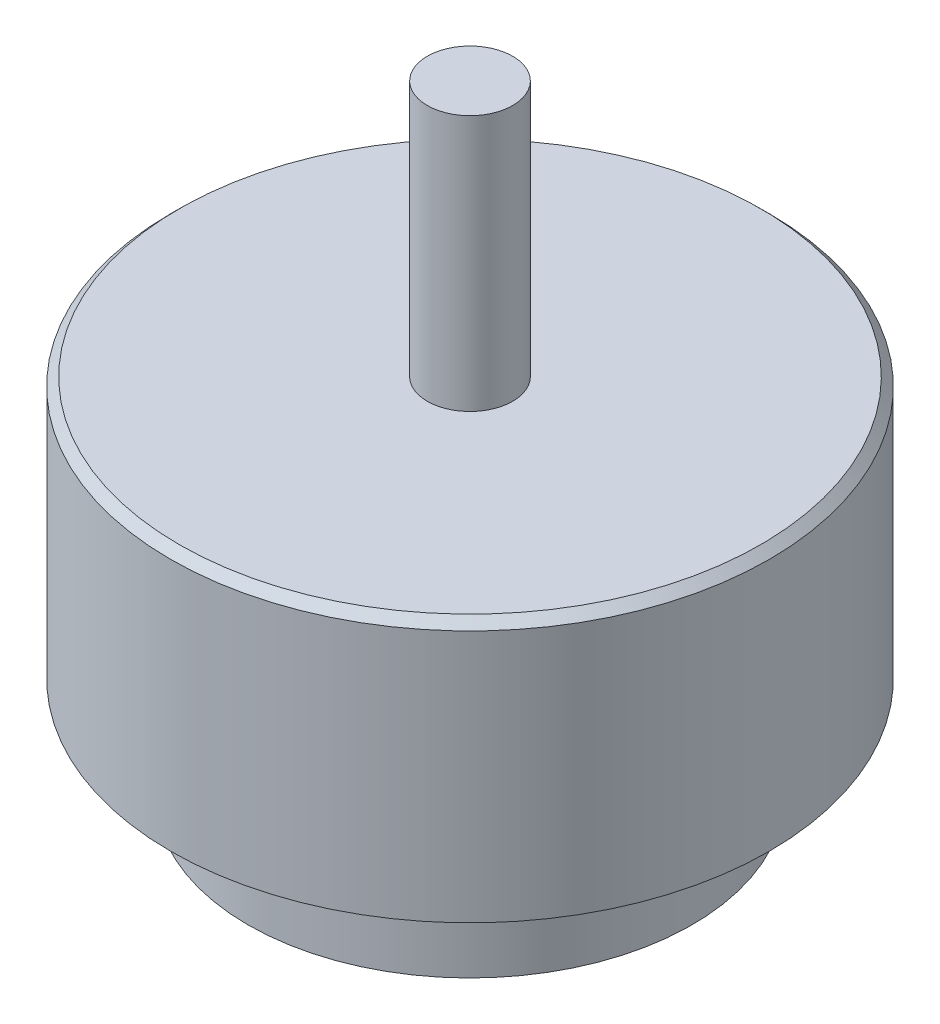
ISO-10303-21;
HEADER;
FILE_DESCRIPTION(('STEP AP214'),'2;1');
FILE_NAME('part.step','',(''),(''),'','','');
FILE_SCHEMA(('AUTOMOTIVE_DESIGN { 1 0 10303 214 1 1 1 1 }'));
ENDSEC;
DATA;
#1=APPLICATION_CONTEXT('core data for automotive mechanical design processes');
#2=APPLICATION_PROTOCOL_DEFINITION('international standard','automotive_design',2000,#1);
#3=PRODUCT_CONTEXT('',#1,'mechanical');
#4=PRODUCT('Part','Part','',(#3));
#5=PRODUCT_RELATED_PRODUCT_CATEGORY('part','',(#4));
#6=PRODUCT_DEFINITION_FORMATION('','',#4);
#7=PRODUCT_DEFINITION_CONTEXT('part definition',#1,'design');
#8=PRODUCT_DEFINITION('design','',#6,#7);
#9=PRODUCT_DEFINITION_SHAPE('','',#8);
#10=(LENGTH_UNIT() NAMED_UNIT(*) SI_UNIT(.MILLI.,.METRE.));
#11=(NAMED_UNIT(*) PLANE_ANGLE_UNIT() SI_UNIT($,.RADIAN.));
#12=(NAMED_UNIT(*) SI_UNIT($,.STERADIAN.) SOLID_ANGLE_UNIT());
#13=UNCERTAINTY_MEASURE_WITH_UNIT(LENGTH_MEASURE(1.E-05),#10,'distance_accuracy_value','');
#14=(GEOMETRIC_REPRESENTATION_CONTEXT(3) GLOBAL_UNCERTAINTY_ASSIGNED_CONTEXT((#13)) GLOBAL_UNIT_ASSIGNED_CONTEXT((#10,
#11,#12)) REPRESENTATION_CONTEXT('',''));
#15=CARTESIAN_POINT('',(0.,0.,0.));
#16=DIRECTION('',(0.,0.,1.));
#17=DIRECTION('',(1.,0.,0.));
#18=AXIS2_PLACEMENT_3D('',#15,#16,#17);
#19=CARTESIAN_POINT('',(0.,6.,0.));
#20=DIRECTION('',(0.,-1.,0.));
#21=DIRECTION('',(0.,0.,-1.));
#22=AXIS2_PLACEMENT_3D('',#19,#20,#21);
#23=CYLINDRICAL_SURFACE('',#22,13.);
#24=CARTESIAN_POINT('',(0.,6.,0.));
#25=DIRECTION('',(0.,1.,0.));
#26=DIRECTION('',(0.,0.,1.));
#27=AXIS2_PLACEMENT_3D('',#24,#25,#26);
#28=CIRCLE('',#27,13.);
#29=CARTESIAN_POINT('',(0.,6.,13.));
#30=VERTEX_POINT('',#29);
#31=EDGE_CURVE('E50',#30,#30,#28,.T.);
#32=ORIENTED_EDGE('',*,*,#31,.F.);
#33=EDGE_LOOP('',(#32));
#34=FACE_BOUND('',#33,.T.);
#35=CARTESIAN_POINT('',(0.,0.,0.));
#36=DIRECTION('',(0.,1.,0.));
#37=DIRECTION('',(0.,0.,1.));
#38=AXIS2_PLACEMENT_3D('',#35,#36,#37);
#39=CIRCLE('',#38,13.);
#40=CARTESIAN_POINT('',(0.,0.,13.));
#41=VERTEX_POINT('',#40);
#42=EDGE_CURVE('E54',#41,#41,#39,.T.);
#43=ORIENTED_EDGE('',*,*,#42,.T.);
#44=EDGE_LOOP('',(#43));
#45=FACE_BOUND('',#44,.T.);
#46=ADVANCED_FACE('F38',(#34,#45),#23,.T.);
#47=CARTESIAN_POINT('',(0.,0.,0.));
#48=DIRECTION('',(0.,1.,0.));
#49=DIRECTION('',(0.,0.,1.));
#50=AXIS2_PLACEMENT_3D('',#47,#48,#49);
#51=PLANE('',#50);
#52=CARTESIAN_POINT('',(0.,0.,0.));
#53=DIRECTION('',(0.,-1.,0.));
#54=DIRECTION('',(0.,0.,-1.));
#55=AXIS2_PLACEMENT_3D('',#52,#53,#54);
#56=CIRCLE('',#55,7.);
#57=CARTESIAN_POINT('',(0.,0.,-7.));
#58=VERTEX_POINT('',#57);
#59=EDGE_CURVE('E69',#58,#58,#56,.T.);
#60=ORIENTED_EDGE('',*,*,#59,.F.);
#61=EDGE_LOOP('',(#60));
#62=FACE_BOUND('',#61,.T.);
#63=ORIENTED_EDGE('',*,*,#42,.F.);
#64=EDGE_LOOP('',(#63));
#65=FACE_BOUND('',#64,.T.);
#66=ADVANCED_FACE('F83',(#62,#65),#51,.F.);
#67=CARTESIAN_POINT('',(0.,21.3,0.));
#68=DIRECTION('',(0.,-1.,0.));
#69=DIRECTION('',(0.,0.,-1.));
#70=AXIS2_PLACEMENT_3D('',#67,#68,#69);
#71=CYLINDRICAL_SURFACE('',#70,17.53);
#72=CARTESIAN_POINT('',(0.,20.8,0.));
#73=DIRECTION('',(0.,1.,0.));
#74=DIRECTION('',(0.,0.,1.));
#75=AXIS2_PLACEMENT_3D('',#72,#73,#74);
#76=CIRCLE('',#75,17.53);
#77=CARTESIAN_POINT('',(0.,20.8,17.53));
#78=VERTEX_POINT('',#77);
#79=EDGE_CURVE('E10',#78,#78,#76,.F.);
#80=ORIENTED_EDGE('',*,*,#79,.T.);
#81=EDGE_LOOP('',(#80));
#82=FACE_BOUND('',#81,.T.);
#83=CARTESIAN_POINT('',(0.,6.,0.));
#84=DIRECTION('',(0.,1.,0.));
#85=DIRECTION('',(0.,0.,1.));
#86=AXIS2_PLACEMENT_3D('',#83,#84,#85);
#87=CIRCLE('',#86,17.53);
#88=CARTESIAN_POINT('',(0.,6.,17.53));
#89=VERTEX_POINT('',#88);
#90=EDGE_CURVE('E58',#89,#89,#87,.T.);
#91=ORIENTED_EDGE('',*,*,#90,.T.);
#92=EDGE_LOOP('',(#91));
#93=FACE_BOUND('',#92,.T.);
#94=ADVANCED_FACE('F86',(#82,#93),#71,.T.);
#95=CARTESIAN_POINT('',(0.,21.3,0.));
#96=DIRECTION('',(0.,1.,0.));
#97=DIRECTION('',(0.,0.,1.));
#98=AXIS2_PLACEMENT_3D('',#95,#96,#97);
#99=PLANE('',#98);
#100=CARTESIAN_POINT('',(0.,21.3,0.));
#101=DIRECTION('',(0.,1.,0.));
#102=DIRECTION('',(0.,0.,1.));
#103=AXIS2_PLACEMENT_3D('',#100,#101,#102);
#104=CIRCLE('',#103,17.03);
#105=CARTESIAN_POINT('',(0.,21.3,17.03));
#106=VERTEX_POINT('',#105);
#107=EDGE_CURVE('E46',#106,#106,#104,.T.);
#108=ORIENTED_EDGE('',*,*,#107,.T.);
#109=EDGE_LOOP('',(#108));
#110=FACE_BOUND('',#109,.T.);
#111=CARTESIAN_POINT('',(0.,21.3,0.));
#112=DIRECTION('',(0.,1.,0.));
#113=DIRECTION('',(0.,0.,1.));
#114=AXIS2_PLACEMENT_3D('',#111,#112,#113);
#115=CIRCLE('',#114,2.5);
#116=CARTESIAN_POINT('',(0.,21.3,2.5));
#117=VERTEX_POINT('',#116);
#118=EDGE_CURVE('E63',#117,#117,#115,.T.);
#119=ORIENTED_EDGE('',*,*,#118,.F.);
#120=EDGE_LOOP('',(#119));
#121=FACE_BOUND('',#120,.T.);
#122=ADVANCED_FACE('F98',(#110,#121),#99,.T.);
#123=CARTESIAN_POINT('',(0.,6.,0.));
#124=DIRECTION('',(0.,1.,0.));
#125=DIRECTION('',(0.,0.,1.));
#126=AXIS2_PLACEMENT_3D('',#123,#124,#125);
#127=PLANE('',#126);
#128=ORIENTED_EDGE('',*,*,#31,.T.);
#129=EDGE_LOOP('',(#128));
#130=FACE_BOUND('',#129,.T.);
#131=ORIENTED_EDGE('',*,*,#90,.F.);
#132=EDGE_LOOP('',(#131));
#133=FACE_BOUND('',#132,.T.);
#134=ADVANCED_FACE('F99',(#130,#133),#127,.F.);
#135=CARTESIAN_POINT('',(0.,36.3,0.));
#136=DIRECTION('',(0.,-1.,0.));
#137=DIRECTION('',(0.,0.,-1.));
#138=AXIS2_PLACEMENT_3D('',#135,#136,#137);
#139=CYLINDRICAL_SURFACE('',#138,2.5);
#140=CARTESIAN_POINT('',(0.,36.3,0.));
#141=DIRECTION('',(0.,1.,0.));
#142=DIRECTION('',(0.,0.,1.));
#143=AXIS2_PLACEMENT_3D('',#140,#141,#142);
#144=CIRCLE('',#143,2.5);
#145=CARTESIAN_POINT('',(0.,36.3,2.5));
#146=VERTEX_POINT('',#145);
#147=EDGE_CURVE('E62',#146,#146,#144,.T.);
#148=ORIENTED_EDGE('',*,*,#147,.F.);
#149=EDGE_LOOP('',(#148));
#150=FACE_BOUND('',#149,.T.);
#151=ORIENTED_EDGE('',*,*,#118,.T.);
#152=EDGE_LOOP('',(#151));
#153=FACE_BOUND('',#152,.T.);
#154=ADVANCED_FACE('F102',(#150,#153),#139,.T.);
#155=CARTESIAN_POINT('',(0.,36.3,0.));
#156=DIRECTION('',(0.,1.,0.));
#157=DIRECTION('',(0.,0.,1.));
#158=AXIS2_PLACEMENT_3D('',#155,#156,#157);
#159=PLANE('',#158);
#160=ORIENTED_EDGE('',*,*,#147,.T.);
#161=EDGE_LOOP('',(#160));
#162=FACE_BOUND('',#161,.T.);
#163=ADVANCED_FACE('F108',(#162),#159,.T.);
#164=CARTESIAN_POINT('',(0.,21.3,0.));
#165=DIRECTION('',(0.,-1.,0.));
#166=DIRECTION('',(0.,0.,-1.));
#167=AXIS2_PLACEMENT_3D('',#164,#165,#166);
#168=CONICAL_SURFACE('',#167,17.03,0.785398163397441);
#169=ORIENTED_EDGE('',*,*,#79,.F.);
#170=EDGE_LOOP('',(#169));
#171=FACE_BOUND('',#170,.T.);
#172=ORIENTED_EDGE('',*,*,#107,.F.);
#173=EDGE_LOOP('',(#172));
#174=FACE_BOUND('',#173,.T.);
#175=ADVANCED_FACE('F41',(#171,#174),#168,.T.);
#176=CARTESIAN_POINT('',(0.,6.,0.));
#177=DIRECTION('',(0.,-1.,0.));
#178=DIRECTION('',(0.,0.,-1.));
#179=AXIS2_PLACEMENT_3D('',#176,#177,#178);
#180=CYLINDRICAL_SURFACE('',#179,7.);
#181=CARTESIAN_POINT('',(0.,6.,0.));
#182=DIRECTION('',(0.,-1.,0.));
#183=DIRECTION('',(0.,0.,-1.));
#184=AXIS2_PLACEMENT_3D('',#181,#182,#183);
#185=CIRCLE('',#184,7.);
#186=CARTESIAN_POINT('',(0.,6.,-7.));
#187=VERTEX_POINT('',#186);
#188=EDGE_CURVE('E66',#187,#187,#185,.T.);
#189=ORIENTED_EDGE('',*,*,#188,.F.);
#190=EDGE_LOOP('',(#189));
#191=FACE_BOUND('',#190,.T.);
#192=ORIENTED_EDGE('',*,*,#59,.T.);
#193=EDGE_LOOP('',(#192));
#194=FACE_BOUND('',#193,.T.);
#195=ADVANCED_FACE('F77',(#191,#194),#180,.F.);
#196=CARTESIAN_POINT('',(0.,6.,0.));
#197=DIRECTION('',(0.,-1.,0.));
#198=DIRECTION('',(0.,0.,-1.));
#199=AXIS2_PLACEMENT_3D('',#196,#197,#198);
#200=PLANE('',#199);
#201=ORIENTED_EDGE('',*,*,#188,.T.);
#202=EDGE_LOOP('',(#201));
#203=FACE_BOUND('',#202,.T.);
#204=ADVANCED_FACE('F75',(#203),#200,.T.);
#205=CLOSED_SHELL('',(#46,#66,#94,#122,#134,#154,#163,#175,#195,#204));
#206=MANIFOLD_SOLID_BREP('B2',#205);
#207=ADVANCED_BREP_SHAPE_REPRESENTATION('',(#18,#206),#14);
#208=SHAPE_DEFINITION_REPRESENTATION(#9,#207);
ENDSEC;
END-ISO-10303-21;
